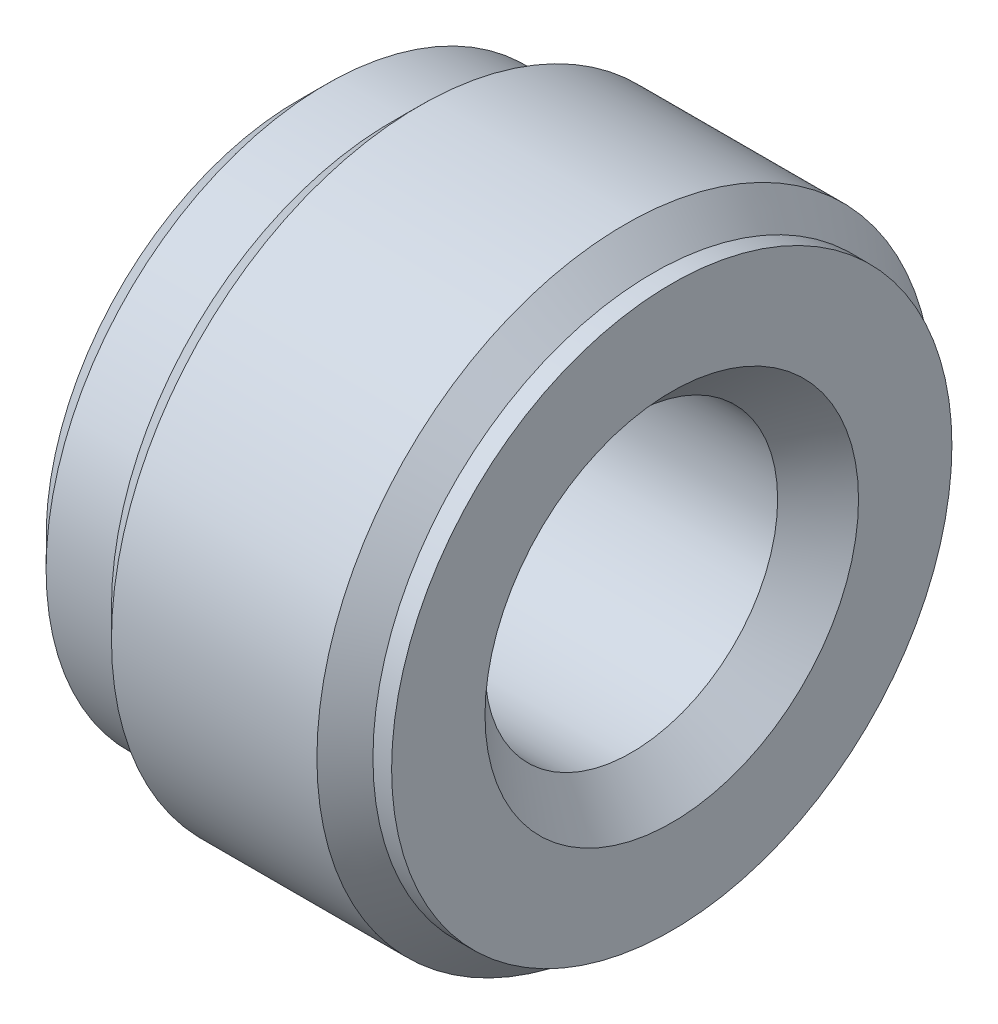
ISO-10303-21;
HEADER;
FILE_DESCRIPTION(('STEP AP214'),'2;1');
FILE_NAME('part.step','',(''),(''),'','','');
FILE_SCHEMA(('AUTOMOTIVE_DESIGN { 1 0 10303 214 1 1 1 1 }'));
ENDSEC;
DATA;
#1=APPLICATION_CONTEXT('core data for automotive mechanical design processes');
#2=APPLICATION_PROTOCOL_DEFINITION('international standard','automotive_design',2000,#1);
#3=PRODUCT_CONTEXT('',#1,'mechanical');
#4=PRODUCT('Part','Part','',(#3));
#5=PRODUCT_RELATED_PRODUCT_CATEGORY('part','',(#4));
#6=PRODUCT_DEFINITION_FORMATION('','',#4);
#7=PRODUCT_DEFINITION_CONTEXT('part definition',#1,'design');
#8=PRODUCT_DEFINITION('design','',#6,#7);
#9=PRODUCT_DEFINITION_SHAPE('','',#8);
#10=(LENGTH_UNIT() NAMED_UNIT(*) SI_UNIT(.MILLI.,.METRE.));
#11=(NAMED_UNIT(*) PLANE_ANGLE_UNIT() SI_UNIT($,.RADIAN.));
#12=(NAMED_UNIT(*) SI_UNIT($,.STERADIAN.) SOLID_ANGLE_UNIT());
#13=UNCERTAINTY_MEASURE_WITH_UNIT(LENGTH_MEASURE(1.E-05),#10,'distance_accuracy_value','');
#14=(GEOMETRIC_REPRESENTATION_CONTEXT(3) GLOBAL_UNCERTAINTY_ASSIGNED_CONTEXT((#13)) GLOBAL_UNIT_ASSIGNED_CONTEXT((#10,
#11,#12)) REPRESENTATION_CONTEXT('',''));
#15=CARTESIAN_POINT('',(0.,0.,0.));
#16=DIRECTION('',(0.,0.,1.));
#17=DIRECTION('',(1.,0.,0.));
#18=AXIS2_PLACEMENT_3D('',#15,#16,#17);
#19=CARTESIAN_POINT('',(0.,0.,0.));
#20=DIRECTION('',(1.,0.,0.));
#21=DIRECTION('',(0.,0.,-1.));
#22=AXIS2_PLACEMENT_3D('',#19,#20,#21);
#23=PLANE('',#22);
#24=CARTESIAN_POINT('',(0.,0.,0.));
#25=DIRECTION('',(1.,0.,0.));
#26=DIRECTION('',(0.,0.,-1.));
#27=AXIS2_PLACEMENT_3D('',#24,#25,#26);
#28=CIRCLE('',#27,1.35);
#29=CARTESIAN_POINT('',(0.,0.,-1.35));
#30=VERTEX_POINT('',#29);
#31=EDGE_CURVE('E60',#30,#30,#28,.T.);
#32=ORIENTED_EDGE('',*,*,#31,.F.);
#33=EDGE_LOOP('',(#32));
#34=FACE_BOUND('',#33,.T.);
#35=CARTESIAN_POINT('',(0.,0.,0.));
#36=DIRECTION('',(1.,0.,0.));
#37=DIRECTION('',(0.,0.,-1.));
#38=AXIS2_PLACEMENT_3D('',#35,#36,#37);
#39=CIRCLE('',#38,0.7835);
#40=CARTESIAN_POINT('',(0.,0.,-0.7835));
#41=VERTEX_POINT('',#40);
#42=EDGE_CURVE('E56',#41,#41,#39,.T.);
#43=ORIENTED_EDGE('',*,*,#42,.T.);
#44=EDGE_LOOP('',(#43));
#45=FACE_BOUND('',#44,.T.);
#46=ADVANCED_FACE('F15',(#34,#45),#23,.F.);
#47=CARTESIAN_POINT('',(0.,0.,0.));
#48=DIRECTION('',(1.,0.,0.));
#49=DIRECTION('',(0.,0.,-1.));
#50=AXIS2_PLACEMENT_3D('',#47,#48,#49);
#51=CONICAL_SURFACE('',#50,1.35,0.785398163397449);
#52=CARTESIAN_POINT('',(0.15,0.,0.));
#53=DIRECTION('',(1.,0.,0.));
#54=DIRECTION('',(0.,0.,-1.));
#55=AXIS2_PLACEMENT_3D('',#52,#53,#54);
#56=CIRCLE('',#55,1.5);
#57=CARTESIAN_POINT('',(0.15,0.,-1.5));
#58=VERTEX_POINT('',#57);
#59=EDGE_CURVE('E52',#58,#58,#56,.T.);
#60=ORIENTED_EDGE('',*,*,#59,.F.);
#61=EDGE_LOOP('',(#60));
#62=FACE_BOUND('',#61,.T.);
#63=ORIENTED_EDGE('',*,*,#31,.T.);
#64=EDGE_LOOP('',(#63));
#65=FACE_BOUND('',#64,.T.);
#66=ADVANCED_FACE('F65',(#62,#65),#51,.T.);
#67=CARTESIAN_POINT('',(2.,0.,0.));
#68=DIRECTION('',(1.,0.,0.));
#69=DIRECTION('',(0.,0.,-1.));
#70=AXIS2_PLACEMENT_3D('',#67,#68,#69);
#71=CYLINDRICAL_SURFACE('',#70,0.7835);
#72=CARTESIAN_POINT('',(1.7835,0.,0.));
#73=DIRECTION('',(1.,0.,0.));
#74=DIRECTION('',(0.,0.,-1.));
#75=AXIS2_PLACEMENT_3D('',#72,#73,#74);
#76=CIRCLE('',#75,0.7835);
#77=CARTESIAN_POINT('',(1.7835,0.,-0.7835));
#78=VERTEX_POINT('',#77);
#79=EDGE_CURVE('E48',#78,#78,#76,.T.);
#80=ORIENTED_EDGE('',*,*,#79,.T.);
#81=EDGE_LOOP('',(#80));
#82=FACE_BOUND('',#81,.T.);
#83=ORIENTED_EDGE('',*,*,#42,.F.);
#84=EDGE_LOOP('',(#83));
#85=FACE_BOUND('',#84,.T.);
#86=ADVANCED_FACE('F72',(#82,#85),#71,.F.);
#87=CARTESIAN_POINT('',(2.,0.,0.));
#88=DIRECTION('',(1.,0.,0.));
#89=DIRECTION('',(0.,0.,-1.));
#90=AXIS2_PLACEMENT_3D('',#87,#88,#89);
#91=CYLINDRICAL_SURFACE('',#90,1.5);
#92=CARTESIAN_POINT('',(0.5,0.,0.));
#93=DIRECTION('',(1.,0.,0.));
#94=DIRECTION('',(0.,0.,-1.));
#95=AXIS2_PLACEMENT_3D('',#92,#93,#94);
#96=CIRCLE('',#95,1.5);
#97=CARTESIAN_POINT('',(0.5,0.,-1.5));
#98=VERTEX_POINT('',#97);
#99=EDGE_CURVE('E44',#98,#98,#96,.T.);
#100=ORIENTED_EDGE('',*,*,#99,.F.);
#101=EDGE_LOOP('',(#100));
#102=FACE_BOUND('',#101,.T.);
#103=ORIENTED_EDGE('',*,*,#59,.T.);
#104=EDGE_LOOP('',(#103));
#105=FACE_BOUND('',#104,.T.);
#106=ADVANCED_FACE('F74',(#102,#105),#91,.T.);
#107=CARTESIAN_POINT('',(1.7835,0.,0.));
#108=DIRECTION('',(1.,0.,0.));
#109=DIRECTION('',(0.,0.,-1.));
#110=AXIS2_PLACEMENT_3D('',#107,#108,#109);
#111=CONICAL_SURFACE('',#110,0.7835,0.785398163397449);
#112=CARTESIAN_POINT('',(2.,0.,0.));
#113=DIRECTION('',(1.,0.,0.));
#114=DIRECTION('',(0.,0.,-1.));
#115=AXIS2_PLACEMENT_3D('',#112,#113,#114);
#116=CIRCLE('',#115,1.);
#117=CARTESIAN_POINT('',(2.,0.,-1.));
#118=VERTEX_POINT('',#117);
#119=EDGE_CURVE('E40',#118,#118,#116,.T.);
#120=ORIENTED_EDGE('',*,*,#119,.T.);
#121=EDGE_LOOP('',(#120));
#122=FACE_BOUND('',#121,.T.);
#123=ORIENTED_EDGE('',*,*,#79,.F.);
#124=EDGE_LOOP('',(#123));
#125=FACE_BOUND('',#124,.T.);
#126=ADVANCED_FACE('F82',(#122,#125),#111,.F.);
#127=CARTESIAN_POINT('',(0.5,0.,0.));
#128=DIRECTION('',(1.,0.,0.));
#129=DIRECTION('',(0.,0.,-1.));
#130=AXIS2_PLACEMENT_3D('',#127,#128,#129);
#131=CONICAL_SURFACE('',#130,1.5,0.785398163397448);
#132=CARTESIAN_POINT('',(0.65,0.,0.));
#133=DIRECTION('',(1.,0.,0.));
#134=DIRECTION('',(0.,0.,-1.));
#135=AXIS2_PLACEMENT_3D('',#132,#133,#134);
#136=CIRCLE('',#135,1.65);
#137=CARTESIAN_POINT('',(0.65,0.,-1.65));
#138=VERTEX_POINT('',#137);
#139=EDGE_CURVE('E34',#138,#138,#136,.T.);
#140=ORIENTED_EDGE('',*,*,#139,.F.);
#141=EDGE_LOOP('',(#140));
#142=FACE_BOUND('',#141,.T.);
#143=ORIENTED_EDGE('',*,*,#99,.T.);
#144=EDGE_LOOP('',(#143));
#145=FACE_BOUND('',#144,.T.);
#146=ADVANCED_FACE('F90',(#142,#145),#131,.T.);
#147=CARTESIAN_POINT('',(2.,1.5,0.));
#148=DIRECTION('',(-1.,0.,0.));
#149=DIRECTION('',(0.,0.,1.));
#150=AXIS2_PLACEMENT_3D('',#147,#148,#149);
#151=PLANE('',#150);
#152=ORIENTED_EDGE('',*,*,#119,.F.);
#153=EDGE_LOOP('',(#152));
#154=FACE_BOUND('',#153,.T.);
#155=CARTESIAN_POINT('',(2.,0.,0.));
#156=DIRECTION('',(1.,0.,0.));
#157=DIRECTION('',(0.,0.,-1.));
#158=AXIS2_PLACEMENT_3D('',#155,#156,#157);
#159=CIRCLE('',#158,1.5);
#160=CARTESIAN_POINT('',(2.,0.,-1.5));
#161=VERTEX_POINT('',#160);
#162=EDGE_CURVE('E29',#161,#161,#159,.T.);
#163=ORIENTED_EDGE('',*,*,#162,.T.);
#164=EDGE_LOOP('',(#163));
#165=FACE_BOUND('',#164,.T.);
#166=ADVANCED_FACE('F94',(#154,#165),#151,.F.);
#167=CARTESIAN_POINT('',(2.,0.,0.));
#168=DIRECTION('',(1.,0.,0.));
#169=DIRECTION('',(0.,0.,-1.));
#170=AXIS2_PLACEMENT_3D('',#167,#168,#169);
#171=CYLINDRICAL_SURFACE('',#170,1.65);
#172=CARTESIAN_POINT('',(1.75,0.,0.));
#173=DIRECTION('',(1.,0.,0.));
#174=DIRECTION('',(0.,0.,-1.));
#175=AXIS2_PLACEMENT_3D('',#172,#173,#174);
#176=CIRCLE('',#175,1.65);
#177=CARTESIAN_POINT('',(1.75,0.,-1.65));
#178=VERTEX_POINT('',#177);
#179=EDGE_CURVE('E23',#178,#178,#176,.T.);
#180=ORIENTED_EDGE('',*,*,#179,.F.);
#181=EDGE_LOOP('',(#180));
#182=FACE_BOUND('',#181,.T.);
#183=ORIENTED_EDGE('',*,*,#139,.T.);
#184=EDGE_LOOP('',(#183));
#185=FACE_BOUND('',#184,.T.);
#186=ADVANCED_FACE('F98',(#182,#185),#171,.T.);
#187=CARTESIAN_POINT('',(2.,0.,0.));
#188=DIRECTION('',(1.,0.,0.));
#189=DIRECTION('',(0.,0.,-1.));
#190=AXIS2_PLACEMENT_3D('',#187,#188,#189);
#191=CYLINDRICAL_SURFACE('',#190,1.5);
#192=ORIENTED_EDGE('',*,*,#162,.F.);
#193=EDGE_LOOP('',(#192));
#194=FACE_BOUND('',#193,.T.);
#195=CARTESIAN_POINT('',(1.9,0.,0.));
#196=DIRECTION('',(1.,0.,0.));
#197=DIRECTION('',(0.,0.,-1.));
#198=AXIS2_PLACEMENT_3D('',#195,#196,#197);
#199=CIRCLE('',#198,1.5);
#200=CARTESIAN_POINT('',(1.9,0.,-1.5));
#201=VERTEX_POINT('',#200);
#202=EDGE_CURVE('E10',#201,#201,#199,.T.);
#203=ORIENTED_EDGE('',*,*,#202,.T.);
#204=EDGE_LOOP('',(#203));
#205=FACE_BOUND('',#204,.T.);
#206=ADVANCED_FACE('F101',(#194,#205),#191,.T.);
#207=CARTESIAN_POINT('',(1.75,0.,0.));
#208=DIRECTION('',(-1.,0.,0.));
#209=DIRECTION('',(0.,0.,1.));
#210=AXIS2_PLACEMENT_3D('',#207,#208,#209);
#211=CONICAL_SURFACE('',#210,1.65,0.785398163397448);
#212=ORIENTED_EDGE('',*,*,#202,.F.);
#213=EDGE_LOOP('',(#212));
#214=FACE_BOUND('',#213,.T.);
#215=ORIENTED_EDGE('',*,*,#179,.T.);
#216=EDGE_LOOP('',(#215));
#217=FACE_BOUND('',#216,.T.);
#218=ADVANCED_FACE('F17',(#214,#217),#211,.T.);
#219=CLOSED_SHELL('',(#46,#66,#86,#106,#126,#146,#166,#186,#206,#218));
#220=MANIFOLD_SOLID_BREP('B1',#219);
#221=ADVANCED_BREP_SHAPE_REPRESENTATION('',(#18,#220),#14);
#222=SHAPE_DEFINITION_REPRESENTATION(#9,#221);
ENDSEC;
END-ISO-10303-21;
